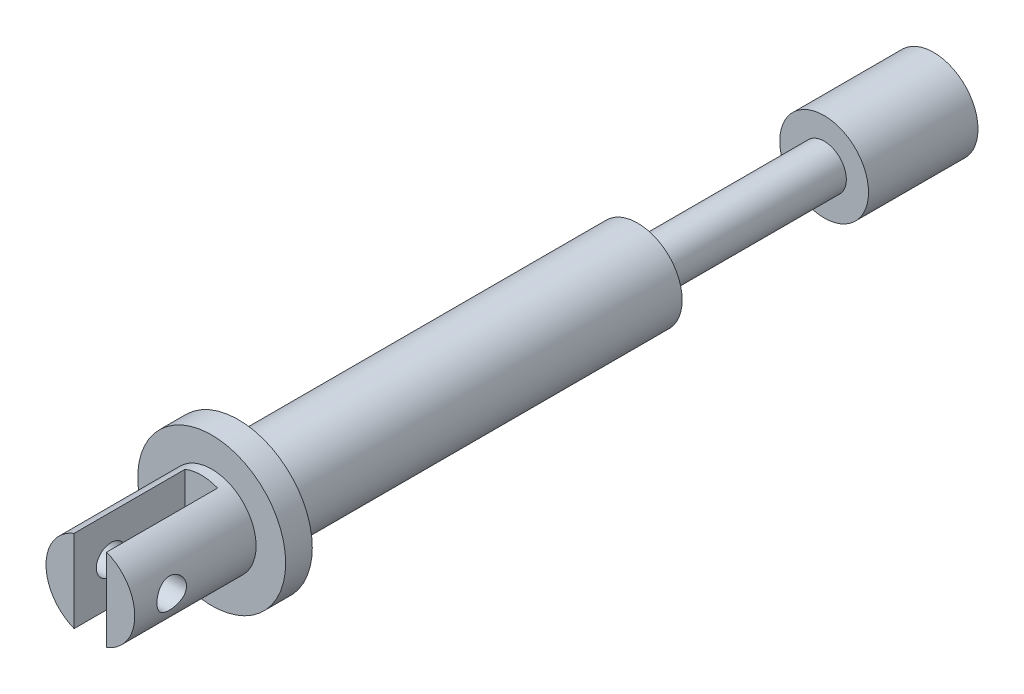
ISO-10303-21;
HEADER;
FILE_DESCRIPTION(('STEP AP214'),'2;1');
FILE_NAME('part.step','',(''),(''),'','','');
FILE_SCHEMA(('AUTOMOTIVE_DESIGN { 1 0 10303 214 1 1 1 1 }'));
ENDSEC;
DATA;
#1=APPLICATION_CONTEXT('core data for automotive mechanical design processes');
#2=APPLICATION_PROTOCOL_DEFINITION('international standard','automotive_design',2000,#1);
#3=PRODUCT_CONTEXT('',#1,'mechanical');
#4=PRODUCT('Part','Part','',(#3));
#5=PRODUCT_RELATED_PRODUCT_CATEGORY('part','',(#4));
#6=PRODUCT_DEFINITION_FORMATION('','',#4);
#7=PRODUCT_DEFINITION_CONTEXT('part definition',#1,'design');
#8=PRODUCT_DEFINITION('design','',#6,#7);
#9=PRODUCT_DEFINITION_SHAPE('','',#8);
#10=(LENGTH_UNIT() NAMED_UNIT(*) SI_UNIT(.MILLI.,.METRE.));
#11=(NAMED_UNIT(*) PLANE_ANGLE_UNIT() SI_UNIT($,.RADIAN.));
#12=(NAMED_UNIT(*) SI_UNIT($,.STERADIAN.) SOLID_ANGLE_UNIT());
#13=UNCERTAINTY_MEASURE_WITH_UNIT(LENGTH_MEASURE(1.E-05),#10,'distance_accuracy_value','');
#14=(GEOMETRIC_REPRESENTATION_CONTEXT(3) GLOBAL_UNCERTAINTY_ASSIGNED_CONTEXT((#13)) GLOBAL_UNIT_ASSIGNED_CONTEXT((#10,
#11,#12)) REPRESENTATION_CONTEXT('',''));
#15=CARTESIAN_POINT('',(0.,0.,0.));
#16=DIRECTION('',(0.,0.,1.));
#17=DIRECTION('',(1.,0.,0.));
#18=AXIS2_PLACEMENT_3D('',#15,#16,#17);
#19=CARTESIAN_POINT('',(0.,0.,28.5));
#20=DIRECTION('',(0.,0.,1.));
#21=DIRECTION('',(1.,0.,0.));
#22=AXIS2_PLACEMENT_3D('',#19,#20,#21);
#23=PLANE('',#22);
#24=DIRECTION('',(0.,1.,0.));
#25=VECTOR('',#24,1.);
#26=CARTESIAN_POINT('',(-1.1,-5.,28.5));
#27=LINE('',#26,#25);
#28=CARTESIAN_POINT('',(-1.1,-2.79105714739057,28.5));
#29=VERTEX_POINT('',#28);
#30=CARTESIAN_POINT('',(-1.1,2.79105714739057,28.5));
#31=VERTEX_POINT('',#30);
#32=EDGE_CURVE('E96',#29,#31,#27,.T.);
#33=ORIENTED_EDGE('',*,*,#32,.T.);
#34=CARTESIAN_POINT('',(0.,0.,28.5));
#35=DIRECTION('',(0.,0.,1.));
#36=DIRECTION('',(1.,0.,0.));
#37=AXIS2_PLACEMENT_3D('',#34,#35,#36);
#38=CIRCLE('',#37,3.);
#39=EDGE_CURVE('E103',#31,#29,#38,.T.);
#40=ORIENTED_EDGE('',*,*,#39,.T.);
#41=EDGE_LOOP('',(#33,#40));
#42=FACE_BOUND('',#41,.T.);
#43=ADVANCED_FACE('F39',(#42),#23,.T.);
#44=CARTESIAN_POINT('',(0.,0.,28.5));
#45=DIRECTION('',(0.,0.,-1.));
#46=DIRECTION('',(-1.,0.,0.));
#47=AXIS2_PLACEMENT_3D('',#44,#45,#46);
#48=CYLINDRICAL_SURFACE('',#47,1.5);
#49=CARTESIAN_POINT('',(0.,0.,-8.5));
#50=DIRECTION('',(0.,0.,1.));
#51=DIRECTION('',(1.,0.,0.));
#52=AXIS2_PLACEMENT_3D('',#49,#50,#51);
#53=CIRCLE('',#52,1.5);
#54=CARTESIAN_POINT('',(1.5,0.,-8.5));
#55=VERTEX_POINT('',#54);
#56=EDGE_CURVE('E116',#55,#55,#53,.T.);
#57=ORIENTED_EDGE('',*,*,#56,.F.);
#58=EDGE_LOOP('',(#57));
#59=FACE_BOUND('',#58,.T.);
#60=CARTESIAN_POINT('',(0.,0.,-21.1));
#61=DIRECTION('',(0.,0.,-1.));
#62=DIRECTION('',(-1.,0.,0.));
#63=AXIS2_PLACEMENT_3D('',#60,#61,#62);
#64=CIRCLE('',#63,1.5);
#65=CARTESIAN_POINT('',(-1.5,0.,-21.1));
#66=VERTEX_POINT('',#65);
#67=EDGE_CURVE('E89',#66,#66,#64,.T.);
#68=ORIENTED_EDGE('',*,*,#67,.F.);
#69=EDGE_LOOP('',(#68));
#70=FACE_BOUND('',#69,.T.);
#71=ADVANCED_FACE('F41',(#59,#70),#48,.T.);
#72=CARTESIAN_POINT('',(0.,0.,-8.5));
#73=DIRECTION('',(0.,0.,1.));
#74=DIRECTION('',(1.,0.,0.));
#75=AXIS2_PLACEMENT_3D('',#72,#73,#74);
#76=CYLINDRICAL_SURFACE('',#75,3.);
#77=CARTESIAN_POINT('',(0.,0.,-8.5));
#78=DIRECTION('',(0.,0.,1.));
#79=DIRECTION('',(1.,0.,0.));
#80=AXIS2_PLACEMENT_3D('',#77,#78,#79);
#81=CIRCLE('',#80,3.);
#82=CARTESIAN_POINT('',(3.,0.,-8.5));
#83=VERTEX_POINT('',#82);
#84=EDGE_CURVE('E109',#83,#83,#81,.T.);
#85=ORIENTED_EDGE('',*,*,#84,.T.);
#86=EDGE_LOOP('',(#85));
#87=FACE_BOUND('',#86,.T.);
#88=CARTESIAN_POINT('',(0.,0.,18.5));
#89=DIRECTION('',(0.,0.,1.));
#90=DIRECTION('',(1.,0.,0.));
#91=AXIS2_PLACEMENT_3D('',#88,#89,#90);
#92=CIRCLE('',#91,3.);
#93=CARTESIAN_POINT('',(3.,0.,18.5));
#94=VERTEX_POINT('',#93);
#95=EDGE_CURVE('E104',#94,#94,#92,.F.);
#96=ORIENTED_EDGE('',*,*,#95,.T.);
#97=EDGE_LOOP('',(#96));
#98=FACE_BOUND('',#97,.T.);
#99=ADVANCED_FACE('F187',(#87,#98),#76,.T.);
#100=CARTESIAN_POINT('',(0.,0.,-8.5));
#101=DIRECTION('',(0.,0.,1.));
#102=DIRECTION('',(1.,0.,0.));
#103=AXIS2_PLACEMENT_3D('',#100,#101,#102);
#104=PLANE('',#103);
#105=ORIENTED_EDGE('',*,*,#56,.T.);
#106=EDGE_LOOP('',(#105));
#107=FACE_BOUND('',#106,.T.);
#108=ORIENTED_EDGE('',*,*,#84,.F.);
#109=EDGE_LOOP('',(#108));
#110=FACE_BOUND('',#109,.T.);
#111=ADVANCED_FACE('F310',(#107,#110),#104,.F.);
#112=CARTESIAN_POINT('',(0.,0.,20.3));
#113=DIRECTION('',(0.,0.,-1.));
#114=DIRECTION('',(-1.,0.,0.));
#115=AXIS2_PLACEMENT_3D('',#112,#113,#114);
#116=CYLINDRICAL_SURFACE('',#115,5.);
#117=CARTESIAN_POINT('',(0.,0.,20.3));
#118=DIRECTION('',(0.,0.,1.));
#119=DIRECTION('',(1.,0.,0.));
#120=AXIS2_PLACEMENT_3D('',#117,#118,#119);
#121=CIRCLE('',#120,5.);
#122=CARTESIAN_POINT('',(5.,0.,20.3));
#123=VERTEX_POINT('',#122);
#124=EDGE_CURVE('E111',#123,#123,#121,.T.);
#125=ORIENTED_EDGE('',*,*,#124,.F.);
#126=EDGE_LOOP('',(#125));
#127=FACE_BOUND('',#126,.T.);
#128=CARTESIAN_POINT('',(0.,0.,18.5));
#129=DIRECTION('',(0.,0.,1.));
#130=DIRECTION('',(1.,0.,0.));
#131=AXIS2_PLACEMENT_3D('',#128,#129,#130);
#132=CIRCLE('',#131,5.);
#133=CARTESIAN_POINT('',(5.,0.,18.5));
#134=VERTEX_POINT('',#133);
#135=EDGE_CURVE('E160',#134,#134,#132,.T.);
#136=ORIENTED_EDGE('',*,*,#135,.T.);
#137=EDGE_LOOP('',(#136));
#138=FACE_BOUND('',#137,.T.);
#139=ADVANCED_FACE('F167',(#127,#138),#116,.T.);
#140=CARTESIAN_POINT('',(0.,0.,20.3));
#141=DIRECTION('',(0.,0.,1.));
#142=DIRECTION('',(1.,0.,0.));
#143=AXIS2_PLACEMENT_3D('',#140,#141,#142);
#144=PLANE('',#143);
#145=CARTESIAN_POINT('',(0.,0.,20.3));
#146=DIRECTION('',(0.,0.,1.));
#147=DIRECTION('',(1.,0.,0.));
#148=AXIS2_PLACEMENT_3D('',#145,#146,#147);
#149=CIRCLE('',#148,3.);
#150=CARTESIAN_POINT('',(3.,0.,20.3));
#151=VERTEX_POINT('',#150);
#152=EDGE_CURVE('E119',#151,#151,#149,.F.);
#153=ORIENTED_EDGE('',*,*,#152,.T.);
#154=EDGE_LOOP('',(#153));
#155=FACE_BOUND('',#154,.T.);
#156=ORIENTED_EDGE('',*,*,#124,.T.);
#157=EDGE_LOOP('',(#156));
#158=FACE_BOUND('',#157,.T.);
#159=ADVANCED_FACE('F171',(#155,#158),#144,.T.);
#160=CARTESIAN_POINT('',(0.,0.,18.5));
#161=DIRECTION('',(0.,0.,1.));
#162=DIRECTION('',(1.,0.,0.));
#163=AXIS2_PLACEMENT_3D('',#160,#161,#162);
#164=PLANE('',#163);
#165=ORIENTED_EDGE('',*,*,#95,.F.);
#166=EDGE_LOOP('',(#165));
#167=FACE_BOUND('',#166,.T.);
#168=ORIENTED_EDGE('',*,*,#135,.F.);
#169=EDGE_LOOP('',(#168));
#170=FACE_BOUND('',#169,.T.);
#171=ADVANCED_FACE('F169',(#167,#170),#164,.F.);
#172=DIRECTION('',(0.,1.,0.));
#173=VECTOR('',#172,1.);
#174=CARTESIAN_POINT('',(1.1,-5.,28.5));
#175=LINE('',#174,#173);
#176=CARTESIAN_POINT('',(1.1,-2.79105714739057,28.5));
#177=VERTEX_POINT('',#176);
#178=CARTESIAN_POINT('',(1.1,2.79105714739057,28.5));
#179=VERTEX_POINT('',#178);
#180=EDGE_CURVE('E82',#177,#179,#175,.T.);
#181=ORIENTED_EDGE('',*,*,#180,.F.);
#182=EDGE_CURVE('E94',#177,#179,#38,.T.);
#183=ORIENTED_EDGE('',*,*,#182,.T.);
#184=EDGE_LOOP('',(#181,#183));
#185=FACE_BOUND('',#184,.T.);
#186=ADVANCED_FACE('F93',(#185),#23,.T.);
#187=CARTESIAN_POINT('',(3.,0.,25.));
#188=CARTESIAN_POINT('',(3.00000015300943,0.0545633628867235,24.9999997462684));
#189=CARTESIAN_POINT('',(2.99849769507545,0.10912519453855,25.0044802661272));
#190=CARTESIAN_POINT('',(2.99265210203281,0.216641760872973,25.0222291088172));
#191=CARTESIAN_POINT('',(2.98830867202153,0.269596328118818,25.0354983439489));
#192=CARTESIAN_POINT('',(2.97725307906443,0.372332789501776,25.070319243384));
#193=CARTESIAN_POINT('',(2.97054487730853,0.422119825886034,25.0918570624593));
#194=CARTESIAN_POINT('',(2.95544445717342,0.517374936805324,25.1425411728383));
#195=CARTESIAN_POINT('',(2.94705190667778,0.562842156958706,25.1716889650026));
#196=CARTESIAN_POINT('',(2.92914094443005,0.649741675022267,25.2378258048588));
#197=CARTESIAN_POINT('',(2.91959556463785,0.69100370029831,25.2750312342605));
#198=CARTESIAN_POINT('',(2.90060314783121,0.766832692702084,25.3557671547066));
#199=CARTESIAN_POINT('',(2.89115613290549,0.801398185489463,25.3992990349285));
#200=CARTESIAN_POINT('',(2.87313332477274,0.863824942227859,25.4929851151965));
#201=CARTESIAN_POINT('',(2.86459039275688,0.891464858221033,25.5432937397321));
#202=CARTESIAN_POINT('',(2.84975305418601,0.937818873877723,25.6481760944585));
#203=CARTESIAN_POINT('',(2.84345796160746,0.956535697386766,25.7027485171627));
#204=CARTESIAN_POINT('',(2.83411303269377,0.983873461509165,25.8126732214967));
#205=CARTESIAN_POINT('',(2.83096095769611,0.99281344827177,25.8679372084891));
#206=CARTESIAN_POINT('',(2.82795656629508,1.00134112333448,25.9792637541559));
#207=CARTESIAN_POINT('',(2.8281032302273,1.00093170160472,26.0353260607092));
#208=CARTESIAN_POINT('',(2.8315901500818,0.991019903703421,26.143936630444));
#209=CARTESIAN_POINT('',(2.83478415867533,0.981933913166996,26.196528402919));
#210=CARTESIAN_POINT('',(2.84376657724551,0.955606162849419,26.2993934196068));
#211=CARTESIAN_POINT('',(2.84955529784108,0.938363426591873,26.3496663854351));
#212=CARTESIAN_POINT('',(2.86317911131249,0.895939058060213,26.4474127495915));
#213=CARTESIAN_POINT('',(2.87104565793117,0.870634048707264,26.4948280254695));
#214=CARTESIAN_POINT('',(2.88792558575726,0.812889106303141,26.5848709082797));
#215=CARTESIAN_POINT('',(2.89693929790464,0.780447112364007,26.6274971269334));
#216=CARTESIAN_POINT('',(2.91567329167741,0.70734933268224,26.7090915981608));
#217=CARTESIAN_POINT('',(2.92540589354843,0.666353150076314,26.7477526945091));
#218=CARTESIAN_POINT('',(2.94406938387037,0.578339569970067,26.8177312666634));
#219=CARTESIAN_POINT('',(2.95300019538067,0.531321595660817,26.8490480381645));
#220=CARTESIAN_POINT('',(2.96917107937794,0.431947613046269,26.9036963002351));
#221=CARTESIAN_POINT('',(2.97639350008039,0.379543276416337,26.9269454913407));
#222=CARTESIAN_POINT('',(2.98820567144435,0.271269083364507,26.9642031739557));
#223=CARTESIAN_POINT('',(2.99279633654879,0.215400438154953,26.9782148754234));
#224=CARTESIAN_POINT('',(2.99867627071441,0.104383829529303,26.9960556660224));
#225=CARTESIAN_POINT('',(3.00010001833731,0.0493095998648448,27.0002998091728));
#226=CARTESIAN_POINT('',(2.99988902694825,-0.0607750699602364,26.9996673264015));
#227=CARTESIAN_POINT('',(2.99825480419352,-0.115785519319647,26.9947922400201));
#228=CARTESIAN_POINT('',(2.99220024717114,-0.222519866304259,26.976388092264));
#229=CARTESIAN_POINT('',(2.98786198711228,-0.274292806834856,26.9631137939505));
#230=CARTESIAN_POINT('',(2.97691846830034,-0.374855958579562,26.9286065555333));
#231=CARTESIAN_POINT('',(2.97031292046541,-0.42364578850856,26.9073726005323));
#232=CARTESIAN_POINT('',(2.95528931287427,-0.518288296393322,26.8569295681591));
#233=CARTESIAN_POINT('',(2.94682814756305,-0.56402995921733,26.8275254067164));
#234=CARTESIAN_POINT('',(2.92905253915743,-0.650064830135404,26.7618058499869));
#235=CARTESIAN_POINT('',(2.91973783591888,-0.690356367794894,26.7254883439698));
#236=CARTESIAN_POINT('',(2.90076847982472,-0.766252507807013,26.6450212489917));
#237=CARTESIAN_POINT('',(2.89111761095155,-0.801560969248491,26.6005907730668));
#238=CARTESIAN_POINT('',(2.87299973286981,-0.864257522320854,26.5062284321955));
#239=CARTESIAN_POINT('',(2.8645327335312,-0.891645547920844,26.4562965213898));
#240=CARTESIAN_POINT('',(2.84982391820308,-0.937596930423362,26.3523269846934));
#241=CARTESIAN_POINT('',(2.84357760900632,-0.956178132197768,26.2982979207572));
#242=CARTESIAN_POINT('',(2.83410832399133,-0.983894666792164,26.1876213498759));
#243=CARTESIAN_POINT('',(2.83088398622698,-0.993034254961245,26.1309750345669));
#244=CARTESIAN_POINT('',(2.82797858875071,-1.00127628247038,26.0198029039868));
#245=CARTESIAN_POINT('',(2.82812400344299,-1.00087025731093,25.9653176597483));
#246=CARTESIAN_POINT('',(2.8315126992356,-0.991242293454879,25.8572349251003));
#247=CARTESIAN_POINT('',(2.83475579595884,-0.982020879458888,25.8036373820471));
#248=CARTESIAN_POINT('',(2.84384524278943,-0.955371813126981,25.6998643369873));
#249=CARTESIAN_POINT('',(2.84964098015514,-0.93810334601488,25.6496431749928));
#250=CARTESIAN_POINT('',(2.86316398825434,-0.895979365760383,25.5527725930645));
#251=CARTESIAN_POINT('',(2.87089168765297,-0.871122168553981,25.5061239688127));
#252=CARTESIAN_POINT('',(2.8878282922406,-0.813260692583251,25.4155163300763));
#253=CARTESIAN_POINT('',(2.89708711641604,-0.779948242764535,25.3717634981014));
#254=CARTESIAN_POINT('',(2.91583356283786,-0.7066428831357,25.290310186616));
#255=CARTESIAN_POINT('',(2.92532124912518,-0.666648084451498,25.252611424312));
#256=CARTESIAN_POINT('',(2.94390030525393,-0.579241556920677,25.1828555877108));
#257=CARTESIAN_POINT('',(2.95296181801216,-0.531601513499728,25.151075652249));
#258=CARTESIAN_POINT('',(2.96925991172652,-0.43135735740663,25.0960095711494));
#259=CARTESIAN_POINT('',(2.9764969590794,-0.37875451813235,25.072721254078));
#260=CARTESIAN_POINT('',(2.98805515068532,-0.272493647200975,25.0362783675113));
#261=CARTESIAN_POINT('',(2.9924921242252,-0.218987757676409,25.0227175337366));
#262=CARTESIAN_POINT('',(2.99846407064225,-0.110320416010248,25.0045797193229));
#263=CARTESIAN_POINT('',(2.99999984531906,-0.0551594255687468,25.0000002565035));
#264=CARTESIAN_POINT('',(3.,0.,25.));
#265=B_SPLINE_CURVE_WITH_KNOTS('',3,(#187,#188,#189,#190,#191,#192,#193,#194,#195,#196,#197,
#198,#199,#200,#201,#202,#203,#204,#205,#206,#207,#208,#209,#210,#211,#212,#213,#214,#215,#216,
#217,#218,#219,#220,#221,#222,#223,#224,#225,#226,#227,#228,#229,#230,#231,#232,#233,#234,#235,
#236,#237,#238,#239,#240,#241,#242,#243,#244,#245,#246,#247,#248,#249,#250,#251,#252,#253,#254,
#255,#256,#257,#258,#259,#260,#261,#262,#263,#264),.UNSPECIFIED.,.T.,.F.,(4,2,2,2,2,2,2,2,2,2,2,
2,2,2,2,2,2,2,2,2,2,2,2,2,2,2,2,2,2,2,2,2,2,2,2,2,2,2,4),(0.,0.163487106026011,0.32699118526752,
0.490222672870273,0.6534863777991,0.821846842827562,0.990244332875301,1.1634838482347,
1.33667044692833,1.5040192574184,1.67131633987485,1.83096826551281,1.99063930855482,
2.15288171155131,2.31517102558207,2.48593305811367,2.65671145966618,2.82918405650358,
3.00159668877209,3.1665358317517,3.33144713164177,3.49158157978214,3.65173645284104,
3.81610399843737,3.98052180821892,4.15241022880752,4.32430008234997,4.49584013824417,
4.66730284700846,4.8299566605662,4.99260079341186,5.15215587070228,5.31174638165788,
5.47830066681615,5.64490211113589,5.81799660824911,5.99104681142267,6.15636558363625,
6.32163866027951),.UNSPECIFIED.);
#266=CARTESIAN_POINT('',(3.,0.,25.));
#267=VERTEX_POINT('',#266);
#268=EDGE_CURVE('E145',#267,#267,#265,.T.);
#269=ORIENTED_EDGE('',*,*,#268,.F.);
#270=EDGE_LOOP('',(#269));
#271=FACE_BOUND('',#270,.T.);
#272=CARTESIAN_POINT('',(-3.,0.,25.));
#273=CARTESIAN_POINT('',(-3.00000015300943,-0.0545633628867232,24.9999997462684));
#274=CARTESIAN_POINT('',(-2.99849769507545,-0.10912519453855,25.0044802661272));
#275=CARTESIAN_POINT('',(-2.99265210203281,-0.216641760872972,25.0222291088172));
#276=CARTESIAN_POINT('',(-2.98830867202153,-0.269596328118818,25.0354983439489));
#277=CARTESIAN_POINT('',(-2.97725307906443,-0.372332789501776,25.070319243384));
#278=CARTESIAN_POINT('',(-2.97054487730853,-0.422119825886034,25.0918570624593));
#279=CARTESIAN_POINT('',(-2.95544445717342,-0.517374936805325,25.1425411728383));
#280=CARTESIAN_POINT('',(-2.94705190667778,-0.562842156958706,25.1716889650026));
#281=CARTESIAN_POINT('',(-2.92914094443005,-0.649741675022267,25.2378258048588));
#282=CARTESIAN_POINT('',(-2.91959556463785,-0.691003700298311,25.2750312342605));
#283=CARTESIAN_POINT('',(-2.90060314783121,-0.766832692702085,25.3557671547066));
#284=CARTESIAN_POINT('',(-2.89115613290549,-0.801398185489464,25.3992990349285));
#285=CARTESIAN_POINT('',(-2.87313332477274,-0.863824942227861,25.4929851151965));
#286=CARTESIAN_POINT('',(-2.86459039275688,-0.891464858221034,25.5432937397321));
#287=CARTESIAN_POINT('',(-2.84975305418601,-0.937818873877724,25.6481760944585));
#288=CARTESIAN_POINT('',(-2.84345796160746,-0.956535697386766,25.7027485171627));
#289=CARTESIAN_POINT('',(-2.83411303269377,-0.983873461509164,25.8126732214967));
#290=CARTESIAN_POINT('',(-2.83096095769611,-0.99281344827177,25.8679372084891));
#291=CARTESIAN_POINT('',(-2.82795656629508,-1.00134112333448,25.9792637541559));
#292=CARTESIAN_POINT('',(-2.8281032302273,-1.00093170160472,26.0353260607092));
#293=CARTESIAN_POINT('',(-2.8315901500818,-0.991019903703421,26.143936630444));
#294=CARTESIAN_POINT('',(-2.83478415867533,-0.981933913166996,26.196528402919));
#295=CARTESIAN_POINT('',(-2.84376657724551,-0.955606162849419,26.2993934196068));
#296=CARTESIAN_POINT('',(-2.84955529784108,-0.938363426591873,26.3496663854351));
#297=CARTESIAN_POINT('',(-2.86317911131249,-0.895939058060213,26.4474127495915));
#298=CARTESIAN_POINT('',(-2.87104565793117,-0.870634048707264,26.4948280254695));
#299=CARTESIAN_POINT('',(-2.88792558575726,-0.812889106303141,26.5848709082797));
#300=CARTESIAN_POINT('',(-2.89693929790464,-0.780447112364007,26.6274971269334));
#301=CARTESIAN_POINT('',(-2.91567329167741,-0.70734933268224,26.7090915981608));
#302=CARTESIAN_POINT('',(-2.92540589354843,-0.666353150076314,26.7477526945091));
#303=CARTESIAN_POINT('',(-2.94406938387037,-0.578339569970067,26.8177312666634));
#304=CARTESIAN_POINT('',(-2.95300019538067,-0.531321595660817,26.8490480381645));
#305=CARTESIAN_POINT('',(-2.96917107937794,-0.43194761304627,26.9036963002351));
#306=CARTESIAN_POINT('',(-2.97639350008039,-0.379543276416339,26.9269454913407));
#307=CARTESIAN_POINT('',(-2.98820567144435,-0.271269083364509,26.9642031739557));
#308=CARTESIAN_POINT('',(-2.99279633654879,-0.215400438154954,26.9782148754234));
#309=CARTESIAN_POINT('',(-2.99867627071441,-0.104383829529303,26.9960556660224));
#310=CARTESIAN_POINT('',(-3.00010001833731,-0.0493095998648448,27.0002998091728));
#311=CARTESIAN_POINT('',(-2.99988902694825,0.0607750699602363,26.9996673264015));
#312=CARTESIAN_POINT('',(-2.99825480419352,0.115785519319647,26.9947922400201));
#313=CARTESIAN_POINT('',(-2.99220024717114,0.222519866304259,26.976388092264));
#314=CARTESIAN_POINT('',(-2.98786198711228,0.274292806834856,26.9631137939505));
#315=CARTESIAN_POINT('',(-2.97691846830034,0.374855958579562,26.9286065555333));
#316=CARTESIAN_POINT('',(-2.97031292046541,0.42364578850856,26.9073726005323));
#317=CARTESIAN_POINT('',(-2.95528931287427,0.518288296393322,26.8569295681591));
#318=CARTESIAN_POINT('',(-2.94682814756305,0.56402995921733,26.8275254067164));
#319=CARTESIAN_POINT('',(-2.92905253915743,0.650064830135404,26.7618058499869));
#320=CARTESIAN_POINT('',(-2.91973783591888,0.690356367794894,26.7254883439698));
#321=CARTESIAN_POINT('',(-2.90076847982472,0.766252507807013,26.6450212489917));
#322=CARTESIAN_POINT('',(-2.89111761095155,0.801560969248491,26.6005907730668));
#323=CARTESIAN_POINT('',(-2.87299973286981,0.864257522320854,26.5062284321955));
#324=CARTESIAN_POINT('',(-2.8645327335312,0.891645547920844,26.4562965213898));
#325=CARTESIAN_POINT('',(-2.84982391820308,0.937596930423362,26.3523269846934));
#326=CARTESIAN_POINT('',(-2.84357760900632,0.956178132197768,26.2982979207572));
#327=CARTESIAN_POINT('',(-2.83410832399133,0.983894666792164,26.1876213498759));
#328=CARTESIAN_POINT('',(-2.83088398622698,0.993034254961245,26.1309750345669));
#329=CARTESIAN_POINT('',(-2.82797858875071,1.00127628247038,26.0198029039868));
#330=CARTESIAN_POINT('',(-2.82812400344299,1.00087025731093,25.9653176597483));
#331=CARTESIAN_POINT('',(-2.8315126992356,0.991242293454879,25.8572349251003));
#332=CARTESIAN_POINT('',(-2.83475579595884,0.982020879458888,25.8036373820471));
#333=CARTESIAN_POINT('',(-2.84384524278943,0.955371813126981,25.6998643369873));
#334=CARTESIAN_POINT('',(-2.84964098015514,0.93810334601488,25.6496431749928));
#335=CARTESIAN_POINT('',(-2.86316398825434,0.895979365760383,25.5527725930645));
#336=CARTESIAN_POINT('',(-2.87089168765297,0.871122168553981,25.5061239688127));
#337=CARTESIAN_POINT('',(-2.8878282922406,0.813260692583251,25.4155163300763));
#338=CARTESIAN_POINT('',(-2.89708711641604,0.779948242764535,25.3717634981014));
#339=CARTESIAN_POINT('',(-2.91583356283786,0.7066428831357,25.290310186616));
#340=CARTESIAN_POINT('',(-2.92532124912518,0.666648084451498,25.252611424312));
#341=CARTESIAN_POINT('',(-2.94390030525393,0.579241556920677,25.1828555877108));
#342=CARTESIAN_POINT('',(-2.95296181801216,0.531601513499729,25.151075652249));
#343=CARTESIAN_POINT('',(-2.96925991172652,0.431357357406631,25.0960095711494));
#344=CARTESIAN_POINT('',(-2.9764969590794,0.378754518132351,25.072721254078));
#345=CARTESIAN_POINT('',(-2.98805515068532,0.272493647200975,25.0362783675113));
#346=CARTESIAN_POINT('',(-2.9924921242252,0.218987757676408,25.0227175337366));
#347=CARTESIAN_POINT('',(-2.99846407064225,0.110320416010247,25.0045797193229));
#348=CARTESIAN_POINT('',(-2.99999984531906,0.0551594255687465,25.0000002565035));
#349=CARTESIAN_POINT('',(-3.,0.,25.));
#350=B_SPLINE_CURVE_WITH_KNOTS('',3,(#272,#273,#274,#275,#276,#277,#278,#279,#280,#281,#282,
#283,#284,#285,#286,#287,#288,#289,#290,#291,#292,#293,#294,#295,#296,#297,#298,#299,#300,#301,
#302,#303,#304,#305,#306,#307,#308,#309,#310,#311,#312,#313,#314,#315,#316,#317,#318,#319,#320,
#321,#322,#323,#324,#325,#326,#327,#328,#329,#330,#331,#332,#333,#334,#335,#336,#337,#338,#339,
#340,#341,#342,#343,#344,#345,#346,#347,#348,#349),.UNSPECIFIED.,.T.,.F.,(4,2,2,2,2,2,2,2,2,2,2,
2,2,2,2,2,2,2,2,2,2,2,2,2,2,2,2,2,2,2,2,2,2,2,2,2,2,2,4),(0.,0.16348710602601,0.326991185267521,
0.490222672870273,0.6534863777991,0.821846842827563,0.990244332875306,1.16348384823471,
1.33667044692834,1.5040192574184,1.67131633987486,1.83096826551281,1.99063930855482,
2.15288171155131,2.31517102558207,2.48593305811367,2.65671145966618,2.82918405650358,
3.00159668877209,3.1665358317517,3.33144713164177,3.49158157978214,3.65173645284104,
3.81610399843737,3.98052180821892,4.15241022880752,4.32430008234997,4.49584013824417,
4.66730284700846,4.8299566605662,4.99260079341186,5.15215587070228,5.31174638165788,
5.47830066681615,5.64490211113589,5.81799660824911,5.99104681142267,6.15636558363625,
6.32163866027951),.UNSPECIFIED.);
#351=CARTESIAN_POINT('',(-3.,0.,25.));
#352=VERTEX_POINT('',#351);
#353=EDGE_CURVE('E149',#352,#352,#350,.T.);
#354=ORIENTED_EDGE('',*,*,#353,.F.);
#355=EDGE_LOOP('',(#354));
#356=FACE_BOUND('',#355,.T.);
#357=DIRECTION('',(0.,0.,1.));
#358=VECTOR('',#357,1.);
#359=CARTESIAN_POINT('',(-1.1,2.79105714739057,-8.5));
#360=LINE('',#359,#358);
#361=CARTESIAN_POINT('',(-1.1,2.79105714739057,21.));
#362=VERTEX_POINT('',#361);
#363=EDGE_CURVE('E11',#362,#31,#360,.T.);
#364=ORIENTED_EDGE('',*,*,#363,.F.);
#365=CARTESIAN_POINT('',(0.,0.,21.));
#366=DIRECTION('',(0.,0.,-1.));
#367=DIRECTION('',(-1.,0.,0.));
#368=AXIS2_PLACEMENT_3D('',#365,#366,#367);
#369=CIRCLE('',#368,3.);
#370=CARTESIAN_POINT('',(1.1,2.79105714739057,21.));
#371=VERTEX_POINT('',#370);
#372=EDGE_CURVE('E49',#371,#362,#369,.F.);
#373=ORIENTED_EDGE('',*,*,#372,.F.);
#374=DIRECTION('',(0.,0.,1.));
#375=VECTOR('',#374,1.);
#376=CARTESIAN_POINT('',(1.1,2.79105714739057,-8.5));
#377=LINE('',#376,#375);
#378=EDGE_CURVE('E101',#179,#371,#377,.F.);
#379=ORIENTED_EDGE('',*,*,#378,.F.);
#380=ORIENTED_EDGE('',*,*,#182,.F.);
#381=DIRECTION('',(0.,0.,1.));
#382=VECTOR('',#381,1.);
#383=CARTESIAN_POINT('',(1.1,-2.79105714739057,-8.5));
#384=LINE('',#383,#382);
#385=CARTESIAN_POINT('',(1.1,-2.79105714739057,21.));
#386=VERTEX_POINT('',#385);
#387=EDGE_CURVE('E79',#386,#177,#384,.T.);
#388=ORIENTED_EDGE('',*,*,#387,.F.);
#389=CARTESIAN_POINT('',(-1.1,-2.79105714739057,21.));
#390=VERTEX_POINT('',#389);
#391=EDGE_CURVE('E88',#390,#386,#369,.F.);
#392=ORIENTED_EDGE('',*,*,#391,.F.);
#393=DIRECTION('',(0.,0.,1.));
#394=VECTOR('',#393,1.);
#395=CARTESIAN_POINT('',(-1.1,-2.79105714739057,-8.5));
#396=LINE('',#395,#394);
#397=EDGE_CURVE('E129',#29,#390,#396,.F.);
#398=ORIENTED_EDGE('',*,*,#397,.F.);
#399=ORIENTED_EDGE('',*,*,#39,.F.);
#400=EDGE_LOOP('',(#364,#373,#379,#380,#388,#392,#398,#399));
#401=FACE_BOUND('',#400,.T.);
#402=ORIENTED_EDGE('',*,*,#152,.F.);
#403=EDGE_LOOP('',(#402));
#404=FACE_BOUND('',#403,.T.);
#405=ADVANCED_FACE('F99',(#271,#356,#401,#404),#76,.T.);
#406=CARTESIAN_POINT('',(0.,0.,-21.1));
#407=DIRECTION('',(0.,0.,-1.));
#408=DIRECTION('',(-1.,0.,0.));
#409=AXIS2_PLACEMENT_3D('',#406,#407,#408);
#410=PLANE('',#409);
#411=ORIENTED_EDGE('',*,*,#67,.T.);
#412=EDGE_LOOP('',(#411));
#413=FACE_BOUND('',#412,.T.);
#414=CARTESIAN_POINT('',(0.,0.,-21.1));
#415=DIRECTION('',(0.,0.,-1.));
#416=DIRECTION('',(-1.,0.,0.));
#417=AXIS2_PLACEMENT_3D('',#414,#415,#416);
#418=CIRCLE('',#417,3.);
#419=CARTESIAN_POINT('',(-3.,0.,-21.1));
#420=VERTEX_POINT('',#419);
#421=EDGE_CURVE('E152',#420,#420,#418,.T.);
#422=ORIENTED_EDGE('',*,*,#421,.F.);
#423=EDGE_LOOP('',(#422));
#424=FACE_BOUND('',#423,.T.);
#425=ADVANCED_FACE('F202',(#413,#424),#410,.F.);
#426=CARTESIAN_POINT('',(0.,0.,-36.9852813742386));
#427=DIRECTION('',(0.,0.,1.));
#428=DIRECTION('',(1.,0.,0.));
#429=AXIS2_PLACEMENT_3D('',#426,#427,#428);
#430=CYLINDRICAL_SURFACE('',#429,3.);
#431=CARTESIAN_POINT('',(0.,0.,-28.5));
#432=DIRECTION('',(0.,0.,1.));
#433=DIRECTION('',(1.,0.,0.));
#434=AXIS2_PLACEMENT_3D('',#431,#432,#433);
#435=CIRCLE('',#434,3.);
#436=CARTESIAN_POINT('',(3.,0.,-28.5));
#437=VERTEX_POINT('',#436);
#438=EDGE_CURVE('E156',#437,#437,#435,.T.);
#439=ORIENTED_EDGE('',*,*,#438,.T.);
#440=EDGE_LOOP('',(#439));
#441=FACE_BOUND('',#440,.T.);
#442=ORIENTED_EDGE('',*,*,#421,.T.);
#443=EDGE_LOOP('',(#442));
#444=FACE_BOUND('',#443,.T.);
#445=ADVANCED_FACE('F194',(#441,#444),#430,.T.);
#446=CARTESIAN_POINT('',(0.,0.,-28.5));
#447=DIRECTION('',(0.,0.,1.));
#448=DIRECTION('',(1.,0.,0.));
#449=AXIS2_PLACEMENT_3D('',#446,#447,#448);
#450=PLANE('',#449);
#451=ORIENTED_EDGE('',*,*,#438,.F.);
#452=EDGE_LOOP('',(#451));
#453=FACE_BOUND('',#452,.T.);
#454=ADVANCED_FACE('F192',(#453),#450,.F.);
#455=CARTESIAN_POINT('',(-1.1,-5.,21.));
#456=DIRECTION('',(-1.,0.,0.));
#457=DIRECTION('',(0.,0.,1.));
#458=AXIS2_PLACEMENT_3D('',#455,#456,#457);
#459=PLANE('',#458);
#460=CARTESIAN_POINT('',(-1.1,0.,26.));
#461=DIRECTION('',(-1.,0.,0.));
#462=DIRECTION('',(0.,0.,1.));
#463=AXIS2_PLACEMENT_3D('',#460,#461,#462);
#464=CIRCLE('',#463,1.);
#465=CARTESIAN_POINT('',(-1.1,0.,27.));
#466=VERTEX_POINT('',#465);
#467=EDGE_CURVE('E240',#466,#466,#464,.T.);
#468=ORIENTED_EDGE('',*,*,#467,.T.);
#469=EDGE_LOOP('',(#468));
#470=FACE_BOUND('',#469,.T.);
#471=ORIENTED_EDGE('',*,*,#397,.T.);
#472=DIRECTION('',(0.,1.,0.));
#473=VECTOR('',#472,1.);
#474=CARTESIAN_POINT('',(-1.1,-5.,21.));
#475=LINE('',#474,#473);
#476=EDGE_CURVE('E136',#390,#362,#475,.T.);
#477=ORIENTED_EDGE('',*,*,#476,.T.);
#478=ORIENTED_EDGE('',*,*,#363,.T.);
#479=ORIENTED_EDGE('',*,*,#32,.F.);
#480=EDGE_LOOP('',(#471,#477,#478,#479));
#481=FACE_BOUND('',#480,.T.);
#482=ADVANCED_FACE('F142',(#470,#481),#459,.F.);
#483=CARTESIAN_POINT('',(-1.1,-5.,21.));
#484=DIRECTION('',(0.,0.,-1.));
#485=DIRECTION('',(-1.,0.,0.));
#486=AXIS2_PLACEMENT_3D('',#483,#484,#485);
#487=PLANE('',#486);
#488=ORIENTED_EDGE('',*,*,#391,.T.);
#489=DIRECTION('',(0.,1.,0.));
#490=VECTOR('',#489,1.);
#491=CARTESIAN_POINT('',(1.1,-5.,21.));
#492=LINE('',#491,#490);
#493=EDGE_CURVE('E56',#386,#371,#492,.T.);
#494=ORIENTED_EDGE('',*,*,#493,.T.);
#495=ORIENTED_EDGE('',*,*,#372,.T.);
#496=ORIENTED_EDGE('',*,*,#476,.F.);
#497=EDGE_LOOP('',(#488,#494,#495,#496));
#498=FACE_BOUND('',#497,.T.);
#499=ADVANCED_FACE('F134',(#498),#487,.F.);
#500=CARTESIAN_POINT('',(1.1,-5.,21.));
#501=DIRECTION('',(1.,0.,0.));
#502=DIRECTION('',(0.,0.,-1.));
#503=AXIS2_PLACEMENT_3D('',#500,#501,#502);
#504=PLANE('',#503);
#505=CARTESIAN_POINT('',(1.1,0.,26.));
#506=DIRECTION('',(1.,0.,0.));
#507=DIRECTION('',(0.,0.,-1.));
#508=AXIS2_PLACEMENT_3D('',#505,#506,#507);
#509=CIRCLE('',#508,1.);
#510=CARTESIAN_POINT('',(1.1,0.,25.));
#511=VERTEX_POINT('',#510);
#512=EDGE_CURVE('E43',#511,#511,#509,.T.);
#513=ORIENTED_EDGE('',*,*,#512,.T.);
#514=EDGE_LOOP('',(#513));
#515=FACE_BOUND('',#514,.T.);
#516=ORIENTED_EDGE('',*,*,#378,.T.);
#517=ORIENTED_EDGE('',*,*,#493,.F.);
#518=ORIENTED_EDGE('',*,*,#387,.T.);
#519=ORIENTED_EDGE('',*,*,#180,.T.);
#520=EDGE_LOOP('',(#516,#517,#518,#519));
#521=FACE_BOUND('',#520,.T.);
#522=ADVANCED_FACE('F81',(#515,#521),#504,.F.);
#523=CARTESIAN_POINT('',(-5.,0.,26.));
#524=DIRECTION('',(1.,0.,0.));
#525=DIRECTION('',(0.,0.,-1.));
#526=AXIS2_PLACEMENT_3D('',#523,#524,#525);
#527=CYLINDRICAL_SURFACE('',#526,1.);
#528=ORIENTED_EDGE('',*,*,#268,.T.);
#529=EDGE_LOOP('',(#528));
#530=FACE_BOUND('',#529,.T.);
#531=ORIENTED_EDGE('',*,*,#512,.F.);
#532=EDGE_LOOP('',(#531));
#533=FACE_BOUND('',#532,.T.);
#534=ADVANCED_FACE('F219',(#530,#533),#527,.F.);
#535=ORIENTED_EDGE('',*,*,#353,.T.);
#536=EDGE_LOOP('',(#535));
#537=FACE_BOUND('',#536,.T.);
#538=ORIENTED_EDGE('',*,*,#467,.F.);
#539=EDGE_LOOP('',(#538));
#540=FACE_BOUND('',#539,.T.);
#541=ADVANCED_FACE('F223',(#537,#540),#527,.F.);
#542=CLOSED_SHELL('',(#43,#71,#99,#111,#139,#159,#171,#186,#405,#425,#445,#454,#482,#499,#522,
#534,#541));
#543=MANIFOLD_SOLID_BREP('B2',#542);
#544=ADVANCED_BREP_SHAPE_REPRESENTATION('',(#18,#543),#14);
#545=SHAPE_DEFINITION_REPRESENTATION(#9,#544);
ENDSEC;
END-ISO-10303-21;
